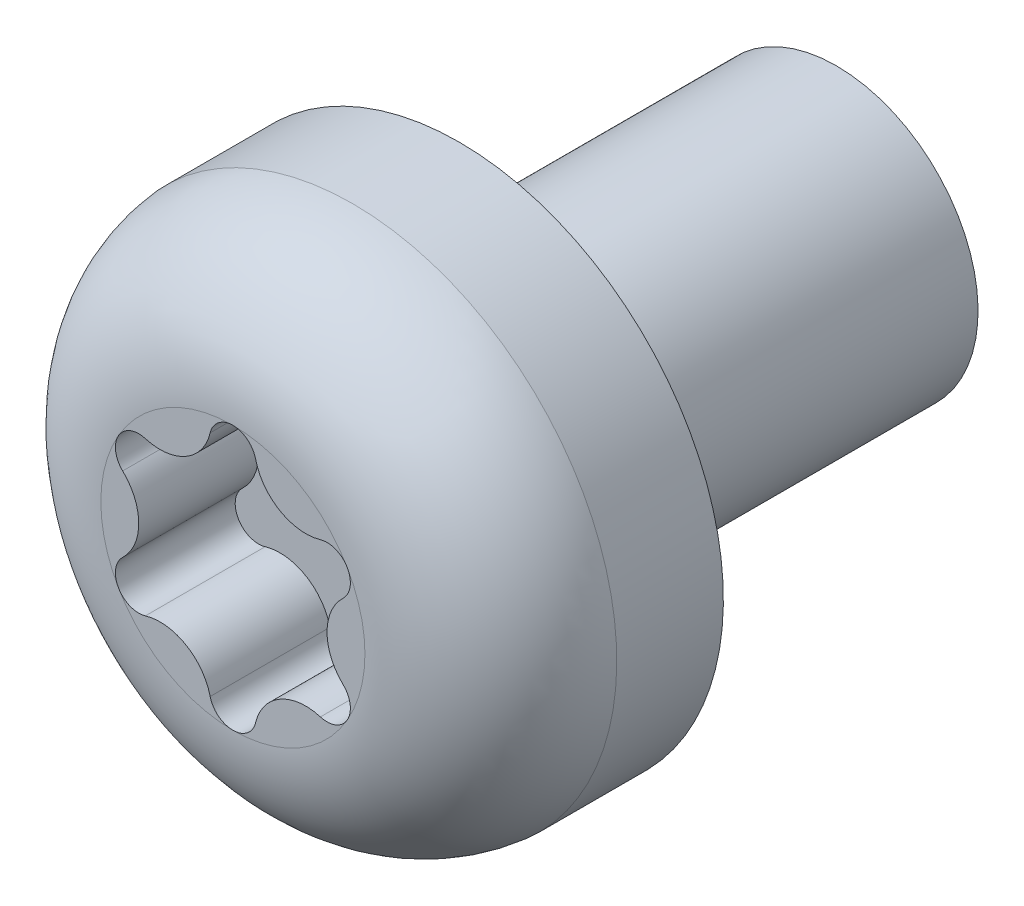
ISO-10303-21;
HEADER;
FILE_DESCRIPTION(('STEP AP214'),'2;1');
FILE_NAME('part.step','',(''),(''),'','','');
FILE_SCHEMA(('AUTOMOTIVE_DESIGN { 1 0 10303 214 1 1 1 1 }'));
ENDSEC;
DATA;
#1=APPLICATION_CONTEXT('core data for automotive mechanical design processes');
#2=APPLICATION_PROTOCOL_DEFINITION('international standard','automotive_design',2000,#1);
#3=PRODUCT_CONTEXT('',#1,'mechanical');
#4=PRODUCT('Part','Part','',(#3));
#5=PRODUCT_RELATED_PRODUCT_CATEGORY('part','',(#4));
#6=PRODUCT_DEFINITION_FORMATION('','',#4);
#7=PRODUCT_DEFINITION_CONTEXT('part definition',#1,'design');
#8=PRODUCT_DEFINITION('design','',#6,#7);
#9=PRODUCT_DEFINITION_SHAPE('','',#8);
#10=(LENGTH_UNIT() NAMED_UNIT(*) SI_UNIT(.MILLI.,.METRE.));
#11=(NAMED_UNIT(*) PLANE_ANGLE_UNIT() SI_UNIT($,.RADIAN.));
#12=(NAMED_UNIT(*) SI_UNIT($,.STERADIAN.) SOLID_ANGLE_UNIT());
#13=UNCERTAINTY_MEASURE_WITH_UNIT(LENGTH_MEASURE(1.E-05),#10,'distance_accuracy_value','');
#14=(GEOMETRIC_REPRESENTATION_CONTEXT(3) GLOBAL_UNCERTAINTY_ASSIGNED_CONTEXT((#13)) GLOBAL_UNIT_ASSIGNED_CONTEXT((#10,
#11,#12)) REPRESENTATION_CONTEXT('',''));
#15=CARTESIAN_POINT('',(0.,0.,0.));
#16=DIRECTION('',(0.,0.,1.));
#17=DIRECTION('',(1.,0.,0.));
#18=AXIS2_PLACEMENT_3D('',#15,#16,#17);
#19=CARTESIAN_POINT('',(0.,0.,2.4));
#20=DIRECTION('',(0.,0.,1.));
#21=DIRECTION('',(0.,-1.,0.));
#22=AXIS2_PLACEMENT_3D('',#19,#20,#21);
#23=PLANE('',#22);
#24=CARTESIAN_POINT('',(0.998035801344209,0.576216238566963,2.4));
#25=DIRECTION('',(0.,0.,1.));
#26=DIRECTION('',(-1.,0.,0.));
#27=AXIS2_PLACEMENT_3D('',#24,#25,#26);
#28=CIRCLE('',#27,0.247567522866081);
#29=CARTESIAN_POINT('',(1.16844714996964,0.39663436131397,2.4));
#30=VERTEX_POINT('',#29);
#31=CARTESIAN_POINT('',(1.21243556529822,0.700000000000004,2.4));
#32=VERTEX_POINT('',#31);
#33=EDGE_CURVE('E223',#30,#32,#28,.T.);
#34=ORIENTED_EDGE('',*,*,#33,.F.);
#35=CARTESIAN_POINT('',(1.54482697992028,0.,2.4));
#36=DIRECTION('',(0.,0.,-1.));
#37=DIRECTION('',(1.,0.,0.));
#38=AXIS2_PLACEMENT_3D('',#35,#36,#37);
#39=CIRCLE('',#38,0.546791178576075);
#40=CARTESIAN_POINT('',(1.16844714996965,-0.396634361313967,2.4));
#41=VERTEX_POINT('',#40);
#42=EDGE_CURVE('E219',#41,#30,#39,.T.);
#43=ORIENTED_EDGE('',*,*,#42,.F.);
#44=CARTESIAN_POINT('',(0.998035801344216,-0.576216238566959,2.4));
#45=DIRECTION('',(0.,0.,1.));
#46=DIRECTION('',(-1.,0.,0.));
#47=AXIS2_PLACEMENT_3D('',#44,#45,#46);
#48=CIRCLE('',#47,0.247567522866081);
#49=CARTESIAN_POINT('',(1.21243556529823,-0.699999999999998,2.4));
#50=VERTEX_POINT('',#49);
#51=EDGE_CURVE('E216',#50,#41,#48,.T.);
#52=ORIENTED_EDGE('',*,*,#51,.F.);
#53=CARTESIAN_POINT('',(0.,0.,2.4));
#54=DIRECTION('',(0.,0.,-1.));
#55=DIRECTION('',(0.,1.,0.));
#56=AXIS2_PLACEMENT_3D('',#53,#54,#55);
#57=CIRCLE('',#56,1.4);
#58=EDGE_CURVE('E45',#32,#50,#57,.T.);
#59=ORIENTED_EDGE('',*,*,#58,.F.);
#60=EDGE_LOOP('',(#34,#43,#52,#59));
#61=FACE_BOUND('',#60,.T.);
#62=ADVANCED_FACE('F37',(#61),#23,.T.);
#63=CARTESIAN_POINT('',(0.927719007896534,0.813587734196249,2.4));
#64=VERTEX_POINT('',#63);
#65=EDGE_CURVE('E222',#32,#64,#28,.T.);
#66=ORIENTED_EDGE('',*,*,#65,.F.);
#67=CARTESIAN_POINT('',(0.,1.4,2.4));
#68=VERTEX_POINT('',#67);
#69=EDGE_CURVE('E11',#68,#32,#57,.T.);
#70=ORIENTED_EDGE('',*,*,#69,.F.);
#71=CARTESIAN_POINT('',(0.,1.15243247713392,2.4));
#72=DIRECTION('',(0.,0.,1.));
#73=DIRECTION('',(-1.,0.,0.));
#74=AXIS2_PLACEMENT_3D('',#71,#72,#73);
#75=CIRCLE('',#74,0.247567522866081);
#76=CARTESIAN_POINT('',(0.240728142073107,1.21022209551021,2.4));
#77=VERTEX_POINT('',#76);
#78=EDGE_CURVE('E61',#77,#68,#75,.T.);
#79=ORIENTED_EDGE('',*,*,#78,.F.);
#80=CARTESIAN_POINT('',(0.772413489960139,1.33785940906255,2.4));
#81=DIRECTION('',(0.,0.,-1.));
#82=DIRECTION('',(1.,0.,0.));
#83=AXIS2_PLACEMENT_3D('',#80,#81,#82);
#84=CIRCLE('',#83,0.546791178576075);
#85=EDGE_CURVE('E225',#64,#77,#84,.T.);
#86=ORIENTED_EDGE('',*,*,#85,.F.);
#87=EDGE_LOOP('',(#66,#70,#79,#86));
#88=FACE_BOUND('',#87,.T.);
#89=ADVANCED_FACE('F311',(#88),#23,.T.);
#90=CARTESIAN_POINT('',(0.92771900789654,-0.813587734196245,2.4));
#91=VERTEX_POINT('',#90);
#92=EDGE_CURVE('E217',#91,#50,#48,.T.);
#93=ORIENTED_EDGE('',*,*,#92,.F.);
#94=CARTESIAN_POINT('',(0.772413489960152,-1.33785940906255,2.4));
#95=DIRECTION('',(0.,0.,-1.));
#96=DIRECTION('',(1.,0.,0.));
#97=AXIS2_PLACEMENT_3D('',#94,#95,#96);
#98=CIRCLE('',#97,0.546791178576075);
#99=CARTESIAN_POINT('',(0.240728142073119,-1.21022209551022,2.4));
#100=VERTEX_POINT('',#99);
#101=EDGE_CURVE('E213',#100,#91,#98,.T.);
#102=ORIENTED_EDGE('',*,*,#101,.F.);
#103=CARTESIAN_POINT('',(0.,-1.15243247713393,2.4));
#104=DIRECTION('',(0.,0.,1.));
#105=DIRECTION('',(-1.,0.,0.));
#106=AXIS2_PLACEMENT_3D('',#103,#104,#105);
#107=CIRCLE('',#106,0.247567522866081);
#108=CARTESIAN_POINT('',(0.,-1.40000000000001,2.4));
#109=VERTEX_POINT('',#108);
#110=EDGE_CURVE('E210',#109,#100,#107,.T.);
#111=ORIENTED_EDGE('',*,*,#110,.F.);
#112=EDGE_CURVE('E274',#50,#109,#57,.T.);
#113=ORIENTED_EDGE('',*,*,#112,.F.);
#114=EDGE_LOOP('',(#93,#102,#111,#113));
#115=FACE_BOUND('',#114,.T.);
#116=ADVANCED_FACE('F290',(#115),#23,.T.);
#117=CARTESIAN_POINT('',(-0.240728142073107,1.21022209551021,2.4));
#118=VERTEX_POINT('',#117);
#119=EDGE_CURVE('E170',#68,#118,#75,.T.);
#120=ORIENTED_EDGE('',*,*,#119,.F.);
#121=CARTESIAN_POINT('',(-1.21243556529822,0.699999999999992,2.4));
#122=VERTEX_POINT('',#121);
#123=EDGE_CURVE('E46',#122,#68,#57,.T.);
#124=ORIENTED_EDGE('',*,*,#123,.F.);
#125=CARTESIAN_POINT('',(-0.998035801344203,0.576216238566951,2.4));
#126=DIRECTION('',(0.,0.,1.));
#127=DIRECTION('',(-1.,0.,0.));
#128=AXIS2_PLACEMENT_3D('',#125,#126,#127);
#129=CIRCLE('',#128,0.24756752286608);
#130=CARTESIAN_POINT('',(-0.927719007896528,0.813587734196237,2.4));
#131=VERTEX_POINT('',#130);
#132=EDGE_CURVE('E53',#131,#122,#129,.T.);
#133=ORIENTED_EDGE('',*,*,#132,.F.);
#134=CARTESIAN_POINT('',(-0.772413489960141,1.33785940906255,2.4));
#135=DIRECTION('',(0.,0.,-1.));
#136=DIRECTION('',(1.,0.,0.));
#137=AXIS2_PLACEMENT_3D('',#134,#135,#136);
#138=CIRCLE('',#137,0.546791178576075);
#139=EDGE_CURVE('E153',#118,#131,#138,.T.);
#140=ORIENTED_EDGE('',*,*,#139,.F.);
#141=EDGE_LOOP('',(#120,#124,#133,#140));
#142=FACE_BOUND('',#141,.T.);
#143=ADVANCED_FACE('F303',(#142),#23,.T.);
#144=CARTESIAN_POINT('',(-0.240728142073093,-1.21022209551022,2.4));
#145=VERTEX_POINT('',#144);
#146=EDGE_CURVE('E211',#145,#109,#107,.T.);
#147=ORIENTED_EDGE('',*,*,#146,.F.);
#148=CARTESIAN_POINT('',(-0.772413489960126,-1.33785940906256,2.4));
#149=DIRECTION('',(0.,0.,-1.));
#150=DIRECTION('',(1.,0.,0.));
#151=AXIS2_PLACEMENT_3D('',#148,#149,#150);
#152=CIRCLE('',#151,0.546791178576074);
#153=CARTESIAN_POINT('',(-0.927719007896521,-0.813587734196256,2.4));
#154=VERTEX_POINT('',#153);
#155=EDGE_CURVE('E207',#154,#145,#152,.T.);
#156=ORIENTED_EDGE('',*,*,#155,.F.);
#157=CARTESIAN_POINT('',(-0.998035801344196,-0.576216238566971,2.4));
#158=DIRECTION('',(0.,0.,1.));
#159=DIRECTION('',(-1.,0.,0.));
#160=AXIS2_PLACEMENT_3D('',#157,#158,#159);
#161=CIRCLE('',#160,0.247567522866081);
#162=CARTESIAN_POINT('',(-1.21243556529821,-0.700000000000014,2.4));
#163=VERTEX_POINT('',#162);
#164=EDGE_CURVE('E204',#163,#154,#161,.T.);
#165=ORIENTED_EDGE('',*,*,#164,.F.);
#166=EDGE_CURVE('E271',#109,#163,#57,.T.);
#167=ORIENTED_EDGE('',*,*,#166,.F.);
#168=EDGE_LOOP('',(#147,#156,#165,#167));
#169=FACE_BOUND('',#168,.T.);
#170=ADVANCED_FACE('F296',(#169),#23,.T.);
#171=CARTESIAN_POINT('',(-1.16844714996963,-0.396634361313978,2.4));
#172=VERTEX_POINT('',#171);
#173=EDGE_CURVE('E205',#172,#163,#161,.T.);
#174=ORIENTED_EDGE('',*,*,#173,.F.);
#175=CARTESIAN_POINT('',(-1.54482697992027,0.,2.4));
#176=DIRECTION('',(0.,0.,-1.));
#177=DIRECTION('',(1.,0.,0.));
#178=AXIS2_PLACEMENT_3D('',#175,#176,#177);
#179=CIRCLE('',#178,0.546791178576075);
#180=CARTESIAN_POINT('',(-1.16844714996963,0.396634361313959,2.4));
#181=VERTEX_POINT('',#180);
#182=EDGE_CURVE('E201',#181,#172,#179,.T.);
#183=ORIENTED_EDGE('',*,*,#182,.F.);
#184=EDGE_CURVE('E199',#122,#181,#129,.T.);
#185=ORIENTED_EDGE('',*,*,#184,.F.);
#186=EDGE_CURVE('E266',#163,#122,#57,.T.);
#187=ORIENTED_EDGE('',*,*,#186,.F.);
#188=EDGE_LOOP('',(#174,#183,#185,#187));
#189=FACE_BOUND('',#188,.T.);
#190=ADVANCED_FACE('F39',(#189),#23,.T.);
#191=CARTESIAN_POINT('',(0.,0.,0.993346456692913));
#192=DIRECTION('',(0.,0.,-1.));
#193=DIRECTION('',(0.,1.,0.));
#194=AXIS2_PLACEMENT_3D('',#191,#192,#193);
#195=DEGENERATE_TOROIDAL_SURFACE('',#194,1.4,1.40665354330709,.T.);
#196=ORIENTED_EDGE('',*,*,#69,.T.);
#197=ORIENTED_EDGE('',*,*,#58,.T.);
#198=ORIENTED_EDGE('',*,*,#112,.T.);
#199=ORIENTED_EDGE('',*,*,#166,.T.);
#200=ORIENTED_EDGE('',*,*,#186,.T.);
#201=ORIENTED_EDGE('',*,*,#123,.T.);
#202=EDGE_LOOP('',(#196,#197,#198,#199,#200,#201));
#203=FACE_BOUND('',#202,.T.);
#204=CARTESIAN_POINT('',(0.,0.,1.13));
#205=DIRECTION('',(0.,0.,-1.));
#206=DIRECTION('',(0.,1.,0.));
#207=AXIS2_PLACEMENT_3D('',#204,#205,#206);
#208=CIRCLE('',#207,2.8);
#209=CARTESIAN_POINT('',(0.,2.8,1.13));
#210=VERTEX_POINT('',#209);
#211=EDGE_CURVE('E261',#210,#210,#208,.T.);
#212=ORIENTED_EDGE('',*,*,#211,.F.);
#213=EDGE_LOOP('',(#212));
#214=FACE_BOUND('',#213,.T.);
#215=ADVANCED_FACE('F280',(#203,#214),#195,.T.);
#216=CARTESIAN_POINT('',(0.,0.,2.4));
#217=DIRECTION('',(0.,0.,-1.));
#218=DIRECTION('',(0.,1.,0.));
#219=AXIS2_PLACEMENT_3D('',#216,#217,#218);
#220=CYLINDRICAL_SURFACE('',#219,2.8);
#221=ORIENTED_EDGE('',*,*,#211,.T.);
#222=EDGE_LOOP('',(#221));
#223=FACE_BOUND('',#222,.T.);
#224=CARTESIAN_POINT('',(0.,0.,0.));
#225=DIRECTION('',(0.,0.,-1.));
#226=DIRECTION('',(0.,1.,0.));
#227=AXIS2_PLACEMENT_3D('',#224,#225,#226);
#228=CIRCLE('',#227,2.8);
#229=CARTESIAN_POINT('',(0.,2.8,0.));
#230=VERTEX_POINT('',#229);
#231=EDGE_CURVE('E259',#230,#230,#228,.T.);
#232=ORIENTED_EDGE('',*,*,#231,.F.);
#233=EDGE_LOOP('',(#232));
#234=FACE_BOUND('',#233,.T.);
#235=ADVANCED_FACE('F349',(#223,#234),#220,.T.);
#236=CARTESIAN_POINT('',(0.,2.8,0.));
#237=DIRECTION('',(0.,0.,-1.));
#238=DIRECTION('',(0.,1.,0.));
#239=AXIS2_PLACEMENT_3D('',#236,#237,#238);
#240=PLANE('',#239);
#241=ORIENTED_EDGE('',*,*,#231,.T.);
#242=EDGE_LOOP('',(#241));
#243=FACE_BOUND('',#242,.T.);
#244=CARTESIAN_POINT('',(0.,0.,0.));
#245=DIRECTION('',(0.,0.,-1.));
#246=DIRECTION('',(0.,1.,0.));
#247=AXIS2_PLACEMENT_3D('',#244,#245,#246);
#248=CIRCLE('',#247,1.5);
#249=CARTESIAN_POINT('',(0.,1.5,0.));
#250=VERTEX_POINT('',#249);
#251=EDGE_CURVE('E256',#250,#250,#248,.T.);
#252=ORIENTED_EDGE('',*,*,#251,.F.);
#253=EDGE_LOOP('',(#252));
#254=FACE_BOUND('',#253,.T.);
#255=ADVANCED_FACE('F390',(#243,#254),#240,.T.);
#256=CARTESIAN_POINT('',(0.,0.,2.4));
#257=DIRECTION('',(0.,0.,-1.));
#258=DIRECTION('',(0.,1.,0.));
#259=AXIS2_PLACEMENT_3D('',#256,#257,#258);
#260=CYLINDRICAL_SURFACE('',#259,1.5);
#261=ORIENTED_EDGE('',*,*,#251,.T.);
#262=EDGE_LOOP('',(#261));
#263=FACE_BOUND('',#262,.T.);
#264=CARTESIAN_POINT('',(0.,0.,-4.));
#265=DIRECTION('',(0.,0.,-1.));
#266=DIRECTION('',(0.,1.,0.));
#267=AXIS2_PLACEMENT_3D('',#264,#265,#266);
#268=CIRCLE('',#267,1.5);
#269=CARTESIAN_POINT('',(0.,1.5,-4.));
#270=VERTEX_POINT('',#269);
#271=EDGE_CURVE('E230',#270,#270,#268,.T.);
#272=ORIENTED_EDGE('',*,*,#271,.F.);
#273=EDGE_LOOP('',(#272));
#274=FACE_BOUND('',#273,.T.);
#275=ADVANCED_FACE('F377',(#263,#274),#260,.T.);
#276=CARTESIAN_POINT('',(0.,1.5,-4.));
#277=DIRECTION('',(0.,0.,-1.));
#278=DIRECTION('',(0.,1.,0.));
#279=AXIS2_PLACEMENT_3D('',#276,#277,#278);
#280=PLANE('',#279);
#281=ORIENTED_EDGE('',*,*,#271,.T.);
#282=EDGE_LOOP('',(#281));
#283=FACE_BOUND('',#282,.T.);
#284=ADVANCED_FACE('F372',(#283),#280,.T.);
#285=CARTESIAN_POINT('',(-0.772413489960141,1.33785940906255,1.13));
#286=DIRECTION('',(0.,0.,1.));
#287=DIRECTION('',(1.,0.,0.));
#288=AXIS2_PLACEMENT_3D('',#285,#286,#287);
#289=CYLINDRICAL_SURFACE('',#288,0.546791178576075);
#290=ORIENTED_EDGE('',*,*,#139,.T.);
#291=DIRECTION('',(0.,0.,1.));
#292=VECTOR('',#291,1.);
#293=CARTESIAN_POINT('',(-0.927719007896528,0.813587734196237,1.13));
#294=LINE('',#293,#292);
#295=CARTESIAN_POINT('',(-0.927719007896528,0.813587734196237,1.13));
#296=VERTEX_POINT('',#295);
#297=EDGE_CURVE('E145',#296,#131,#294,.T.);
#298=ORIENTED_EDGE('',*,*,#297,.F.);
#299=CARTESIAN_POINT('',(-0.772413489960141,1.33785940906255,1.13));
#300=DIRECTION('',(0.,0.,-1.));
#301=DIRECTION('',(1.,0.,0.));
#302=AXIS2_PLACEMENT_3D('',#299,#300,#301);
#303=CIRCLE('',#302,0.546791178576075);
#304=CARTESIAN_POINT('',(-0.240728142073107,1.21022209551021,1.13));
#305=VERTEX_POINT('',#304);
#306=EDGE_CURVE('E150',#305,#296,#303,.T.);
#307=ORIENTED_EDGE('',*,*,#306,.F.);
#308=DIRECTION('',(0.,0.,1.));
#309=VECTOR('',#308,1.);
#310=CARTESIAN_POINT('',(-0.240728142073107,1.21022209551021,1.13));
#311=LINE('',#310,#309);
#312=EDGE_CURVE('E228',#305,#118,#311,.T.);
#313=ORIENTED_EDGE('',*,*,#312,.T.);
#314=EDGE_LOOP('',(#290,#298,#307,#313));
#315=FACE_BOUND('',#314,.T.);
#316=ADVANCED_FACE('F147',(#315),#289,.T.);
#317=CARTESIAN_POINT('',(0.,1.15243247713392,1.13));
#318=DIRECTION('',(0.,0.,1.));
#319=DIRECTION('',(1.,0.,0.));
#320=AXIS2_PLACEMENT_3D('',#317,#318,#319);
#321=CYLINDRICAL_SURFACE('',#320,0.247567522866081);
#322=ORIENTED_EDGE('',*,*,#78,.T.);
#323=ORIENTED_EDGE('',*,*,#119,.T.);
#324=ORIENTED_EDGE('',*,*,#312,.F.);
#325=CARTESIAN_POINT('',(0.,1.15243247713392,1.13));
#326=DIRECTION('',(0.,0.,1.));
#327=DIRECTION('',(-1.,0.,0.));
#328=AXIS2_PLACEMENT_3D('',#325,#326,#327);
#329=CIRCLE('',#328,0.247567522866081);
#330=CARTESIAN_POINT('',(0.240728142073107,1.21022209551021,1.13));
#331=VERTEX_POINT('',#330);
#332=EDGE_CURVE('E155',#331,#305,#329,.T.);
#333=ORIENTED_EDGE('',*,*,#332,.F.);
#334=DIRECTION('',(0.,0.,1.));
#335=VECTOR('',#334,1.);
#336=CARTESIAN_POINT('',(0.240728142073107,1.21022209551021,1.13));
#337=LINE('',#336,#335);
#338=EDGE_CURVE('E231',#331,#77,#337,.T.);
#339=ORIENTED_EDGE('',*,*,#338,.T.);
#340=EDGE_LOOP('',(#322,#323,#324,#333,#339));
#341=FACE_BOUND('',#340,.T.);
#342=ADVANCED_FACE('F304',(#341),#321,.F.);
#343=CARTESIAN_POINT('',(0.772413489960139,1.33785940906255,1.13));
#344=DIRECTION('',(0.,0.,1.));
#345=DIRECTION('',(1.,0.,0.));
#346=AXIS2_PLACEMENT_3D('',#343,#344,#345);
#347=CYLINDRICAL_SURFACE('',#346,0.546791178576075);
#348=ORIENTED_EDGE('',*,*,#85,.T.);
#349=ORIENTED_EDGE('',*,*,#338,.F.);
#350=CARTESIAN_POINT('',(0.772413489960139,1.33785940906255,1.13));
#351=DIRECTION('',(0.,0.,-1.));
#352=DIRECTION('',(1.,0.,0.));
#353=AXIS2_PLACEMENT_3D('',#350,#351,#352);
#354=CIRCLE('',#353,0.546791178576075);
#355=CARTESIAN_POINT('',(0.927719007896534,0.813587734196249,1.13));
#356=VERTEX_POINT('',#355);
#357=EDGE_CURVE('E195',#356,#331,#354,.T.);
#358=ORIENTED_EDGE('',*,*,#357,.F.);
#359=DIRECTION('',(0.,0.,1.));
#360=VECTOR('',#359,1.);
#361=CARTESIAN_POINT('',(0.927719007896534,0.813587734196249,1.13));
#362=LINE('',#361,#360);
#363=EDGE_CURVE('E233',#356,#64,#362,.T.);
#364=ORIENTED_EDGE('',*,*,#363,.T.);
#365=EDGE_LOOP('',(#348,#349,#358,#364));
#366=FACE_BOUND('',#365,.T.);
#367=ADVANCED_FACE('F308',(#366),#347,.T.);
#368=CARTESIAN_POINT('',(0.998035801344209,0.576216238566963,1.13));
#369=DIRECTION('',(0.,0.,1.));
#370=DIRECTION('',(1.,0.,0.));
#371=AXIS2_PLACEMENT_3D('',#368,#369,#370);
#372=CYLINDRICAL_SURFACE('',#371,0.247567522866081);
#373=ORIENTED_EDGE('',*,*,#33,.T.);
#374=ORIENTED_EDGE('',*,*,#65,.T.);
#375=ORIENTED_EDGE('',*,*,#363,.F.);
#376=CARTESIAN_POINT('',(0.998035801344209,0.576216238566963,1.13));
#377=DIRECTION('',(0.,0.,1.));
#378=DIRECTION('',(-1.,0.,0.));
#379=AXIS2_PLACEMENT_3D('',#376,#377,#378);
#380=CIRCLE('',#379,0.247567522866081);
#381=CARTESIAN_POINT('',(1.16844714996964,0.39663436131397,1.13));
#382=VERTEX_POINT('',#381);
#383=EDGE_CURVE('E192',#382,#356,#380,.T.);
#384=ORIENTED_EDGE('',*,*,#383,.F.);
#385=DIRECTION('',(0.,0.,1.));
#386=VECTOR('',#385,1.);
#387=CARTESIAN_POINT('',(1.16844714996964,0.39663436131397,1.13));
#388=LINE('',#387,#386);
#389=EDGE_CURVE('E236',#382,#30,#388,.T.);
#390=ORIENTED_EDGE('',*,*,#389,.T.);
#391=EDGE_LOOP('',(#373,#374,#375,#384,#390));
#392=FACE_BOUND('',#391,.T.);
#393=ADVANCED_FACE('F313',(#392),#372,.F.);
#394=CARTESIAN_POINT('',(1.54482697992028,0.,1.13));
#395=DIRECTION('',(0.,0.,1.));
#396=DIRECTION('',(1.,0.,0.));
#397=AXIS2_PLACEMENT_3D('',#394,#395,#396);
#398=CYLINDRICAL_SURFACE('',#397,0.546791178576075);
#399=ORIENTED_EDGE('',*,*,#42,.T.);
#400=ORIENTED_EDGE('',*,*,#389,.F.);
#401=CARTESIAN_POINT('',(1.54482697992028,0.,1.13));
#402=DIRECTION('',(0.,0.,-1.));
#403=DIRECTION('',(1.,0.,0.));
#404=AXIS2_PLACEMENT_3D('',#401,#402,#403);
#405=CIRCLE('',#404,0.546791178576075);
#406=CARTESIAN_POINT('',(1.16844714996965,-0.396634361313967,1.13));
#407=VERTEX_POINT('',#406);
#408=EDGE_CURVE('E189',#407,#382,#405,.T.);
#409=ORIENTED_EDGE('',*,*,#408,.F.);
#410=DIRECTION('',(0.,0.,1.));
#411=VECTOR('',#410,1.);
#412=CARTESIAN_POINT('',(1.16844714996965,-0.396634361313967,1.13));
#413=LINE('',#412,#411);
#414=EDGE_CURVE('E238',#407,#41,#413,.T.);
#415=ORIENTED_EDGE('',*,*,#414,.T.);
#416=EDGE_LOOP('',(#399,#400,#409,#415));
#417=FACE_BOUND('',#416,.T.);
#418=ADVANCED_FACE('F317',(#417),#398,.T.);
#419=CARTESIAN_POINT('',(0.998035801344216,-0.576216238566959,1.13));
#420=DIRECTION('',(0.,0.,1.));
#421=DIRECTION('',(1.,0.,0.));
#422=AXIS2_PLACEMENT_3D('',#419,#420,#421);
#423=CYLINDRICAL_SURFACE('',#422,0.247567522866081);
#424=ORIENTED_EDGE('',*,*,#92,.T.);
#425=ORIENTED_EDGE('',*,*,#51,.T.);
#426=ORIENTED_EDGE('',*,*,#414,.F.);
#427=CARTESIAN_POINT('',(0.998035801344216,-0.576216238566959,1.13));
#428=DIRECTION('',(0.,0.,1.));
#429=DIRECTION('',(-1.,0.,0.));
#430=AXIS2_PLACEMENT_3D('',#427,#428,#429);
#431=CIRCLE('',#430,0.247567522866081);
#432=CARTESIAN_POINT('',(0.92771900789654,-0.813587734196245,1.13));
#433=VERTEX_POINT('',#432);
#434=EDGE_CURVE('E186',#433,#407,#431,.T.);
#435=ORIENTED_EDGE('',*,*,#434,.F.);
#436=DIRECTION('',(0.,0.,1.));
#437=VECTOR('',#436,1.);
#438=CARTESIAN_POINT('',(0.92771900789654,-0.813587734196245,1.13));
#439=LINE('',#438,#437);
#440=EDGE_CURVE('E241',#433,#91,#439,.T.);
#441=ORIENTED_EDGE('',*,*,#440,.T.);
#442=EDGE_LOOP('',(#424,#425,#426,#435,#441));
#443=FACE_BOUND('',#442,.T.);
#444=ADVANCED_FACE('F319',(#443),#423,.F.);
#445=CARTESIAN_POINT('',(0.772413489960152,-1.33785940906255,1.13));
#446=DIRECTION('',(0.,0.,1.));
#447=DIRECTION('',(1.,0.,0.));
#448=AXIS2_PLACEMENT_3D('',#445,#446,#447);
#449=CYLINDRICAL_SURFACE('',#448,0.546791178576075);
#450=ORIENTED_EDGE('',*,*,#101,.T.);
#451=ORIENTED_EDGE('',*,*,#440,.F.);
#452=CARTESIAN_POINT('',(0.772413489960152,-1.33785940906255,1.13));
#453=DIRECTION('',(0.,0.,-1.));
#454=DIRECTION('',(1.,0.,0.));
#455=AXIS2_PLACEMENT_3D('',#452,#453,#454);
#456=CIRCLE('',#455,0.546791178576075);
#457=CARTESIAN_POINT('',(0.240728142073119,-1.21022209551022,1.13));
#458=VERTEX_POINT('',#457);
#459=EDGE_CURVE('E183',#458,#433,#456,.T.);
#460=ORIENTED_EDGE('',*,*,#459,.F.);
#461=DIRECTION('',(0.,0.,1.));
#462=VECTOR('',#461,1.);
#463=CARTESIAN_POINT('',(0.240728142073119,-1.21022209551022,1.13));
#464=LINE('',#463,#462);
#465=EDGE_CURVE('E243',#458,#100,#464,.T.);
#466=ORIENTED_EDGE('',*,*,#465,.T.);
#467=EDGE_LOOP('',(#450,#451,#460,#466));
#468=FACE_BOUND('',#467,.T.);
#469=ADVANCED_FACE('F323',(#468),#449,.T.);
#470=CARTESIAN_POINT('',(0.,-1.15243247713393,1.13));
#471=DIRECTION('',(0.,0.,1.));
#472=DIRECTION('',(1.,0.,0.));
#473=AXIS2_PLACEMENT_3D('',#470,#471,#472);
#474=CYLINDRICAL_SURFACE('',#473,0.247567522866081);
#475=ORIENTED_EDGE('',*,*,#146,.T.);
#476=ORIENTED_EDGE('',*,*,#110,.T.);
#477=ORIENTED_EDGE('',*,*,#465,.F.);
#478=CARTESIAN_POINT('',(0.,-1.15243247713393,1.13));
#479=DIRECTION('',(0.,0.,1.));
#480=DIRECTION('',(-1.,0.,0.));
#481=AXIS2_PLACEMENT_3D('',#478,#479,#480);
#482=CIRCLE('',#481,0.247567522866081);
#483=CARTESIAN_POINT('',(-0.240728142073093,-1.21022209551022,1.13));
#484=VERTEX_POINT('',#483);
#485=EDGE_CURVE('E180',#484,#458,#482,.T.);
#486=ORIENTED_EDGE('',*,*,#485,.F.);
#487=DIRECTION('',(0.,0.,1.));
#488=VECTOR('',#487,1.);
#489=CARTESIAN_POINT('',(-0.240728142073093,-1.21022209551022,1.13));
#490=LINE('',#489,#488);
#491=EDGE_CURVE('E246',#484,#145,#490,.T.);
#492=ORIENTED_EDGE('',*,*,#491,.T.);
#493=EDGE_LOOP('',(#475,#476,#477,#486,#492));
#494=FACE_BOUND('',#493,.T.);
#495=ADVANCED_FACE('F324',(#494),#474,.F.);
#496=CARTESIAN_POINT('',(-0.772413489960126,-1.33785940906256,1.13));
#497=DIRECTION('',(0.,0.,1.));
#498=DIRECTION('',(1.,0.,0.));
#499=AXIS2_PLACEMENT_3D('',#496,#497,#498);
#500=CYLINDRICAL_SURFACE('',#499,0.546791178576074);
#501=ORIENTED_EDGE('',*,*,#155,.T.);
#502=ORIENTED_EDGE('',*,*,#491,.F.);
#503=CARTESIAN_POINT('',(-0.772413489960126,-1.33785940906256,1.13));
#504=DIRECTION('',(0.,0.,-1.));
#505=DIRECTION('',(1.,0.,0.));
#506=AXIS2_PLACEMENT_3D('',#503,#504,#505);
#507=CIRCLE('',#506,0.546791178576074);
#508=CARTESIAN_POINT('',(-0.927719007896521,-0.813587734196256,1.13));
#509=VERTEX_POINT('',#508);
#510=EDGE_CURVE('E177',#509,#484,#507,.T.);
#511=ORIENTED_EDGE('',*,*,#510,.F.);
#512=DIRECTION('',(0.,0.,1.));
#513=VECTOR('',#512,1.);
#514=CARTESIAN_POINT('',(-0.927719007896521,-0.813587734196256,1.13));
#515=LINE('',#514,#513);
#516=EDGE_CURVE('E248',#509,#154,#515,.T.);
#517=ORIENTED_EDGE('',*,*,#516,.T.);
#518=EDGE_LOOP('',(#501,#502,#511,#517));
#519=FACE_BOUND('',#518,.T.);
#520=ADVANCED_FACE('F328',(#519),#500,.T.);
#521=CARTESIAN_POINT('',(-0.998035801344196,-0.576216238566971,1.13));
#522=DIRECTION('',(0.,0.,1.));
#523=DIRECTION('',(1.,0.,0.));
#524=AXIS2_PLACEMENT_3D('',#521,#522,#523);
#525=CYLINDRICAL_SURFACE('',#524,0.247567522866081);
#526=ORIENTED_EDGE('',*,*,#173,.T.);
#527=ORIENTED_EDGE('',*,*,#164,.T.);
#528=ORIENTED_EDGE('',*,*,#516,.F.);
#529=CARTESIAN_POINT('',(-0.998035801344196,-0.576216238566971,1.13));
#530=DIRECTION('',(0.,0.,1.));
#531=DIRECTION('',(-1.,0.,0.));
#532=AXIS2_PLACEMENT_3D('',#529,#530,#531);
#533=CIRCLE('',#532,0.247567522866081);
#534=CARTESIAN_POINT('',(-1.16844714996963,-0.396634361313978,1.13));
#535=VERTEX_POINT('',#534);
#536=EDGE_CURVE('E174',#535,#509,#533,.T.);
#537=ORIENTED_EDGE('',*,*,#536,.F.);
#538=DIRECTION('',(0.,0.,1.));
#539=VECTOR('',#538,1.);
#540=CARTESIAN_POINT('',(-1.16844714996963,-0.396634361313978,1.13));
#541=LINE('',#540,#539);
#542=EDGE_CURVE('E251',#535,#172,#541,.T.);
#543=ORIENTED_EDGE('',*,*,#542,.T.);
#544=EDGE_LOOP('',(#526,#527,#528,#537,#543));
#545=FACE_BOUND('',#544,.T.);
#546=ADVANCED_FACE('F329',(#545),#525,.F.);
#547=CARTESIAN_POINT('',(-1.54482697992027,0.,1.13));
#548=DIRECTION('',(0.,0.,1.));
#549=DIRECTION('',(1.,0.,0.));
#550=AXIS2_PLACEMENT_3D('',#547,#548,#549);
#551=CYLINDRICAL_SURFACE('',#550,0.546791178576075);
#552=ORIENTED_EDGE('',*,*,#182,.T.);
#553=ORIENTED_EDGE('',*,*,#542,.F.);
#554=CARTESIAN_POINT('',(-1.54482697992027,0.,1.13));
#555=DIRECTION('',(0.,0.,-1.));
#556=DIRECTION('',(1.,0.,0.));
#557=AXIS2_PLACEMENT_3D('',#554,#555,#556);
#558=CIRCLE('',#557,0.546791178576075);
#559=CARTESIAN_POINT('',(-1.16844714996963,0.396634361313959,1.13));
#560=VERTEX_POINT('',#559);
#561=EDGE_CURVE('E164',#560,#535,#558,.T.);
#562=ORIENTED_EDGE('',*,*,#561,.F.);
#563=DIRECTION('',(0.,0.,1.));
#564=VECTOR('',#563,1.);
#565=CARTESIAN_POINT('',(-1.16844714996963,0.396634361313959,1.13));
#566=LINE('',#565,#564);
#567=EDGE_CURVE('E154',#560,#181,#566,.T.);
#568=ORIENTED_EDGE('',*,*,#567,.T.);
#569=EDGE_LOOP('',(#552,#553,#562,#568));
#570=FACE_BOUND('',#569,.T.);
#571=ADVANCED_FACE('F331',(#570),#551,.T.);
#572=CARTESIAN_POINT('',(-0.998035801344203,0.576216238566951,1.13));
#573=DIRECTION('',(0.,0.,1.));
#574=DIRECTION('',(1.,0.,0.));
#575=AXIS2_PLACEMENT_3D('',#572,#573,#574);
#576=CYLINDRICAL_SURFACE('',#575,0.24756752286608);
#577=ORIENTED_EDGE('',*,*,#132,.T.);
#578=ORIENTED_EDGE('',*,*,#184,.T.);
#579=ORIENTED_EDGE('',*,*,#567,.F.);
#580=CARTESIAN_POINT('',(-0.998035801344203,0.576216238566951,1.13));
#581=DIRECTION('',(0.,0.,1.));
#582=DIRECTION('',(-1.,0.,0.));
#583=AXIS2_PLACEMENT_3D('',#580,#581,#582);
#584=CIRCLE('',#583,0.24756752286608);
#585=EDGE_CURVE('E158',#296,#560,#584,.T.);
#586=ORIENTED_EDGE('',*,*,#585,.F.);
#587=ORIENTED_EDGE('',*,*,#297,.T.);
#588=EDGE_LOOP('',(#577,#578,#579,#586,#587));
#589=FACE_BOUND('',#588,.T.);
#590=ADVANCED_FACE('F159',(#589),#576,.F.);
#591=CARTESIAN_POINT('',(-0.386206744980071,1.24514594309823,1.13));
#592=DIRECTION('',(0.,0.,1.));
#593=DIRECTION('',(1.,0.,0.));
#594=AXIS2_PLACEMENT_3D('',#591,#592,#593);
#595=PLANE('',#594);
#596=ORIENTED_EDGE('',*,*,#306,.T.);
#597=ORIENTED_EDGE('',*,*,#585,.T.);
#598=ORIENTED_EDGE('',*,*,#561,.T.);
#599=ORIENTED_EDGE('',*,*,#536,.T.);
#600=ORIENTED_EDGE('',*,*,#510,.T.);
#601=ORIENTED_EDGE('',*,*,#485,.T.);
#602=ORIENTED_EDGE('',*,*,#459,.T.);
#603=ORIENTED_EDGE('',*,*,#434,.T.);
#604=ORIENTED_EDGE('',*,*,#408,.T.);
#605=ORIENTED_EDGE('',*,*,#383,.T.);
#606=ORIENTED_EDGE('',*,*,#357,.T.);
#607=ORIENTED_EDGE('',*,*,#332,.T.);
#608=EDGE_LOOP('',(#596,#597,#598,#599,#600,#601,#602,#603,#604,#605,#606,#607));
#609=FACE_BOUND('',#608,.T.);
#610=ADVANCED_FACE('F166',(#609),#595,.T.);
#611=CLOSED_SHELL('',(#62,#89,#116,#143,#170,#190,#215,#235,#255,#275,#284,#316,#342,#367,#393,
#418,#444,#469,#495,#520,#546,#571,#590,#610));
#612=MANIFOLD_SOLID_BREP('B2',#611);
#613=ADVANCED_BREP_SHAPE_REPRESENTATION('',(#18,#612),#14);
#614=SHAPE_DEFINITION_REPRESENTATION(#9,#613);
ENDSEC;
END-ISO-10303-21;
